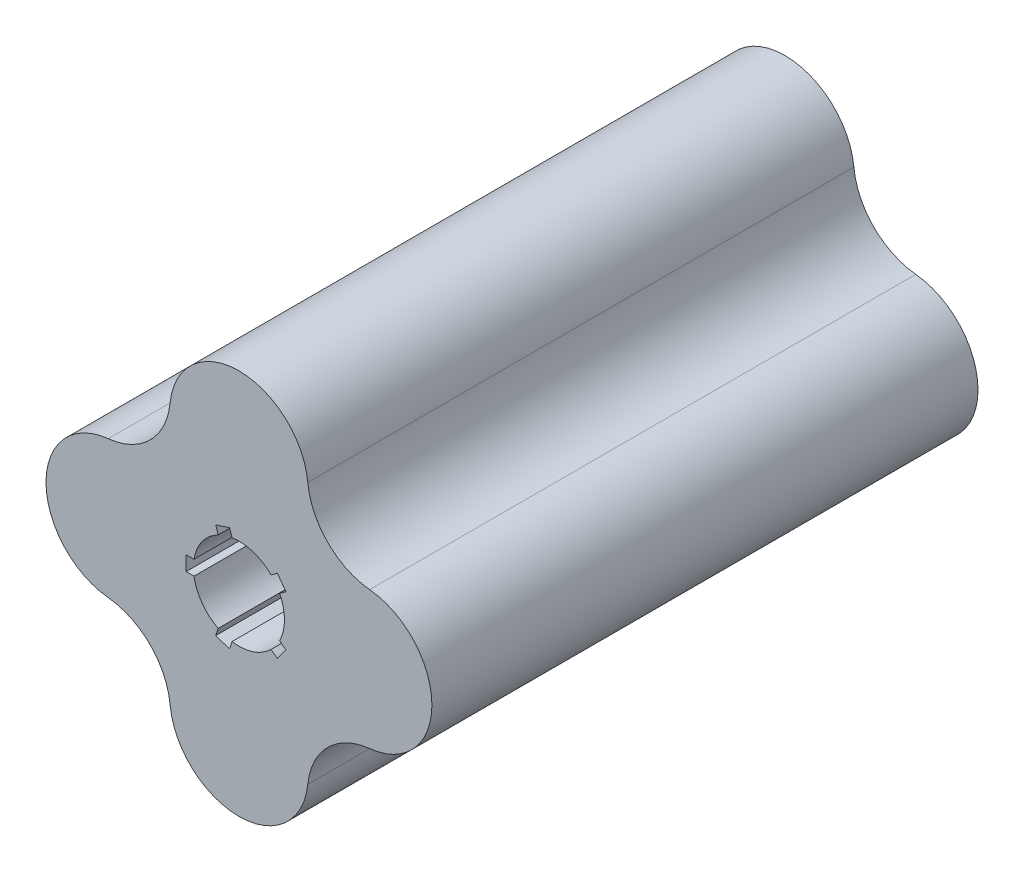
ISO-10303-21;
HEADER;
FILE_DESCRIPTION(('STEP AP214'),'2;1');
FILE_NAME('part.step','',(''),(''),'','','');
FILE_SCHEMA(('AUTOMOTIVE_DESIGN { 1 0 10303 214 1 1 1 1 }'));
ENDSEC;
DATA;
#1=APPLICATION_CONTEXT('core data for automotive mechanical design processes');
#2=APPLICATION_PROTOCOL_DEFINITION('international standard','automotive_design',2000,#1);
#3=PRODUCT_CONTEXT('',#1,'mechanical');
#4=PRODUCT('Part','Part','',(#3));
#5=PRODUCT_RELATED_PRODUCT_CATEGORY('part','',(#4));
#6=PRODUCT_DEFINITION_FORMATION('','',#4);
#7=PRODUCT_DEFINITION_CONTEXT('part definition',#1,'design');
#8=PRODUCT_DEFINITION('design','',#6,#7);
#9=PRODUCT_DEFINITION_SHAPE('','',#8);
#10=(LENGTH_UNIT() NAMED_UNIT(*) SI_UNIT(.MILLI.,.METRE.));
#11=(NAMED_UNIT(*) PLANE_ANGLE_UNIT() SI_UNIT($,.RADIAN.));
#12=(NAMED_UNIT(*) SI_UNIT($,.STERADIAN.) SOLID_ANGLE_UNIT());
#13=UNCERTAINTY_MEASURE_WITH_UNIT(LENGTH_MEASURE(1.E-05),#10,'distance_accuracy_value','');
#14=(GEOMETRIC_REPRESENTATION_CONTEXT(3) GLOBAL_UNCERTAINTY_ASSIGNED_CONTEXT((#13)) GLOBAL_UNIT_ASSIGNED_CONTEXT((#10,
#11,#12)) REPRESENTATION_CONTEXT('',''));
#15=CARTESIAN_POINT('',(0.,0.,0.));
#16=DIRECTION('',(0.,0.,1.));
#17=DIRECTION('',(1.,0.,0.));
#18=AXIS2_PLACEMENT_3D('',#15,#16,#17);
#19=CARTESIAN_POINT('',(0.,0.,150.));
#20=DIRECTION('',(0.,0.,-1.));
#21=DIRECTION('',(-1.,0.,0.));
#22=AXIS2_PLACEMENT_3D('',#19,#20,#21);
#23=CYLINDRICAL_SURFACE('',#22,12.5);
#24=DIRECTION('',(0.,0.,-1.));
#25=VECTOR('',#24,1.);
#26=CARTESIAN_POINT('',(-5.71506219343787,11.1170168716764,150.));
#27=LINE('',#26,#25);
#28=CARTESIAN_POINT('',(-5.71506219343787,11.1170168716764,150.));
#29=VERTEX_POINT('',#28);
#30=CARTESIAN_POINT('',(-5.71506219343787,11.1170168716764,0.));
#31=VERTEX_POINT('',#30);
#32=EDGE_CURVE('E321',#29,#31,#27,.T.);
#33=ORIENTED_EDGE('',*,*,#32,.F.);
#34=CARTESIAN_POINT('',(0.,0.,150.));
#35=DIRECTION('',(0.,0.,1.));
#36=DIRECTION('',(1.,0.,0.));
#37=AXIS2_PLACEMENT_3D('',#34,#35,#36);
#38=CIRCLE('',#37,12.5);
#39=CARTESIAN_POINT('',(-12.3389626792531,2.,150.));
#40=VERTEX_POINT('',#39);
#41=EDGE_CURVE('E370',#29,#40,#38,.T.);
#42=ORIENTED_EDGE('',*,*,#41,.T.);
#43=DIRECTION('',(0.,0.,-1.));
#44=VECTOR('',#43,1.);
#45=CARTESIAN_POINT('',(-12.3389626792531,2.,150.));
#46=LINE('',#45,#44);
#47=CARTESIAN_POINT('',(-12.3389626792531,2.,0.));
#48=VERTEX_POINT('',#47);
#49=EDGE_CURVE('E341',#48,#40,#46,.F.);
#50=ORIENTED_EDGE('',*,*,#49,.F.);
#51=CARTESIAN_POINT('',(0.,0.,0.));
#52=DIRECTION('',(0.,0.,1.));
#53=DIRECTION('',(1.,0.,0.));
#54=AXIS2_PLACEMENT_3D('',#51,#52,#53);
#55=CIRCLE('',#54,12.5);
#56=EDGE_CURVE('E399',#31,#48,#55,.T.);
#57=ORIENTED_EDGE('',*,*,#56,.F.);
#58=EDGE_LOOP('',(#33,#42,#50,#57));
#59=FACE_BOUND('',#58,.T.);
#60=ADVANCED_FACE('F37',(#59),#23,.F.);
#61=DIRECTION('',(0.,0.,-1.));
#62=VECTOR('',#61,1.);
#63=CARTESIAN_POINT('',(-1.91083612825727,12.3530848491762,150.));
#64=LINE('',#63,#62);
#65=CARTESIAN_POINT('',(-1.91083612825727,12.3530848491762,0.));
#66=VERTEX_POINT('',#65);
#67=CARTESIAN_POINT('',(-1.91083612825727,12.3530848491762,150.));
#68=VERTEX_POINT('',#67);
#69=EDGE_CURVE('E319',#66,#68,#64,.F.);
#70=ORIENTED_EDGE('',*,*,#69,.F.);
#71=CARTESIAN_POINT('',(8.80685999588894,8.87069428020215,0.));
#72=VERTEX_POINT('',#71);
#73=EDGE_CURVE('E432',#72,#66,#55,.T.);
#74=ORIENTED_EDGE('',*,*,#73,.F.);
#75=DIRECTION('',(0.,0.,-1.));
#76=VECTOR('',#75,1.);
#77=CARTESIAN_POINT('',(8.80685999588894,8.87069428020215,150.));
#78=LINE('',#77,#76);
#79=CARTESIAN_POINT('',(8.80685999588894,8.87069428020215,150.));
#80=VERTEX_POINT('',#79);
#81=EDGE_CURVE('E317',#80,#72,#78,.T.);
#82=ORIENTED_EDGE('',*,*,#81,.F.);
#83=EDGE_CURVE('E453',#80,#68,#38,.T.);
#84=ORIENTED_EDGE('',*,*,#83,.T.);
#85=EDGE_LOOP('',(#70,#74,#82,#84));
#86=FACE_BOUND('',#85,.T.);
#87=ADVANCED_FACE('F438',(#86),#23,.F.);
#88=DIRECTION('',(0.,0.,-1.));
#89=VECTOR('',#88,1.);
#90=CARTESIAN_POINT('',(11.1580010050589,5.63462630270238,150.));
#91=LINE('',#90,#89);
#92=CARTESIAN_POINT('',(11.1580010050589,5.63462630270238,0.));
#93=VERTEX_POINT('',#92);
#94=CARTESIAN_POINT('',(11.1580010050589,5.63462630270238,150.));
#95=VERTEX_POINT('',#94);
#96=EDGE_CURVE('E315',#93,#95,#91,.F.);
#97=ORIENTED_EDGE('',*,*,#96,.F.);
#98=CARTESIAN_POINT('',(11.1580010050589,-5.63462630270222,0.));
#99=VERTEX_POINT('',#98);
#100=EDGE_CURVE('E441',#99,#93,#55,.T.);
#101=ORIENTED_EDGE('',*,*,#100,.F.);
#102=DIRECTION('',(0.,0.,-1.));
#103=VECTOR('',#102,1.);
#104=CARTESIAN_POINT('',(11.1580010050589,-5.63462630270222,150.));
#105=LINE('',#104,#103);
#106=CARTESIAN_POINT('',(11.1580010050589,-5.63462630270222,150.));
#107=VERTEX_POINT('',#106);
#108=EDGE_CURVE('E313',#107,#99,#105,.T.);
#109=ORIENTED_EDGE('',*,*,#108,.F.);
#110=EDGE_CURVE('E454',#107,#95,#38,.T.);
#111=ORIENTED_EDGE('',*,*,#110,.T.);
#112=EDGE_LOOP('',(#97,#101,#109,#111));
#113=FACE_BOUND('',#112,.T.);
#114=ADVANCED_FACE('F501',(#113),#23,.F.);
#115=DIRECTION('',(0.,0.,-1.));
#116=VECTOR('',#115,1.);
#117=CARTESIAN_POINT('',(8.80685999588907,-8.87069428020202,150.));
#118=LINE('',#117,#116);
#119=CARTESIAN_POINT('',(8.80685999588907,-8.87069428020202,0.));
#120=VERTEX_POINT('',#119);
#121=CARTESIAN_POINT('',(8.80685999588907,-8.87069428020202,150.));
#122=VERTEX_POINT('',#121);
#123=EDGE_CURVE('E242',#120,#122,#118,.F.);
#124=ORIENTED_EDGE('',*,*,#123,.F.);
#125=CARTESIAN_POINT('',(-1.91083612825709,-12.3530848491762,0.));
#126=VERTEX_POINT('',#125);
#127=EDGE_CURVE('E402',#126,#120,#55,.T.);
#128=ORIENTED_EDGE('',*,*,#127,.F.);
#129=DIRECTION('',(0.,0.,-1.));
#130=VECTOR('',#129,1.);
#131=CARTESIAN_POINT('',(-1.91083612825709,-12.3530848491762,150.));
#132=LINE('',#131,#130);
#133=CARTESIAN_POINT('',(-1.91083612825709,-12.3530848491762,150.));
#134=VERTEX_POINT('',#133);
#135=EDGE_CURVE('E310',#134,#126,#132,.T.);
#136=ORIENTED_EDGE('',*,*,#135,.F.);
#137=EDGE_CURVE('E375',#134,#122,#38,.T.);
#138=ORIENTED_EDGE('',*,*,#137,.T.);
#139=EDGE_LOOP('',(#124,#128,#136,#138));
#140=FACE_BOUND('',#139,.T.);
#141=ADVANCED_FACE('F461',(#140),#23,.F.);
#142=CARTESIAN_POINT('',(-37.8086520466848,37.8086520466848,150.));
#143=DIRECTION('',(0.,0.,-1.));
#144=DIRECTION('',(-1.,0.,0.));
#145=AXIS2_PLACEMENT_3D('',#142,#143,#144);
#146=CYLINDRICAL_SURFACE('',#145,19.);
#147=CARTESIAN_POINT('',(-37.8086520466848,37.8086520466848,0.));
#148=DIRECTION('',(0.,0.,1.));
#149=DIRECTION('',(1.,0.,0.));
#150=AXIS2_PLACEMENT_3D('',#147,#148,#149);
#151=CIRCLE('',#150,19.);
#152=CARTESIAN_POINT('',(-35.9043260233424,18.9043260233424,0.));
#153=VERTEX_POINT('',#152);
#154=CARTESIAN_POINT('',(-18.9043260233424,35.9043260233424,0.));
#155=VERTEX_POINT('',#154);
#156=EDGE_CURVE('E348',#153,#155,#151,.T.);
#157=ORIENTED_EDGE('',*,*,#156,.F.);
#158=DIRECTION('',(0.,0.,-1.));
#159=VECTOR('',#158,1.);
#160=CARTESIAN_POINT('',(-35.9043260233424,18.9043260233424,150.));
#161=LINE('',#160,#159);
#162=CARTESIAN_POINT('',(-35.9043260233424,18.9043260233424,150.));
#163=VERTEX_POINT('',#162);
#164=EDGE_CURVE('E416',#163,#153,#161,.T.);
#165=ORIENTED_EDGE('',*,*,#164,.F.);
#166=CARTESIAN_POINT('',(-37.8086520466848,37.8086520466848,150.));
#167=DIRECTION('',(0.,0.,1.));
#168=DIRECTION('',(1.,0.,0.));
#169=AXIS2_PLACEMENT_3D('',#166,#167,#168);
#170=CIRCLE('',#169,19.);
#171=CARTESIAN_POINT('',(-18.9043260233424,35.9043260233424,150.));
#172=VERTEX_POINT('',#171);
#173=EDGE_CURVE('E349',#163,#172,#170,.T.);
#174=ORIENTED_EDGE('',*,*,#173,.T.);
#175=DIRECTION('',(0.,0.,-1.));
#176=VECTOR('',#175,1.);
#177=CARTESIAN_POINT('',(-18.9043260233424,35.9043260233424,150.));
#178=LINE('',#177,#176);
#179=EDGE_CURVE('E374',#172,#155,#178,.T.);
#180=ORIENTED_EDGE('',*,*,#179,.T.);
#181=EDGE_LOOP('',(#157,#165,#174,#180));
#182=FACE_BOUND('',#181,.T.);
#183=ADVANCED_FACE('F39',(#182),#146,.F.);
#184=CARTESIAN_POINT('',(-34.,0.,150.));
#185=DIRECTION('',(0.,0.,-1.));
#186=DIRECTION('',(-1.,0.,0.));
#187=AXIS2_PLACEMENT_3D('',#184,#185,#186);
#188=CYLINDRICAL_SURFACE('',#187,19.);
#189=CARTESIAN_POINT('',(-34.,0.,0.));
#190=DIRECTION('',(0.,0.,1.));
#191=DIRECTION('',(1.,0.,0.));
#192=AXIS2_PLACEMENT_3D('',#189,#190,#191);
#193=CIRCLE('',#192,19.);
#194=CARTESIAN_POINT('',(-35.9043260233424,-18.9043260233424,0.));
#195=VERTEX_POINT('',#194);
#196=EDGE_CURVE('E378',#153,#195,#193,.T.);
#197=ORIENTED_EDGE('',*,*,#196,.T.);
#198=DIRECTION('',(0.,0.,-1.));
#199=VECTOR('',#198,1.);
#200=CARTESIAN_POINT('',(-35.9043260233424,-18.9043260233424,150.));
#201=LINE('',#200,#199);
#202=CARTESIAN_POINT('',(-35.9043260233424,-18.9043260233424,150.));
#203=VERTEX_POINT('',#202);
#204=EDGE_CURVE('E414',#203,#195,#201,.T.);
#205=ORIENTED_EDGE('',*,*,#204,.F.);
#206=CARTESIAN_POINT('',(-34.,0.,150.));
#207=DIRECTION('',(0.,0.,1.));
#208=DIRECTION('',(1.,0.,0.));
#209=AXIS2_PLACEMENT_3D('',#206,#207,#208);
#210=CIRCLE('',#209,19.);
#211=EDGE_CURVE('E352',#163,#203,#210,.T.);
#212=ORIENTED_EDGE('',*,*,#211,.F.);
#213=ORIENTED_EDGE('',*,*,#164,.T.);
#214=EDGE_LOOP('',(#197,#205,#212,#213));
#215=FACE_BOUND('',#214,.T.);
#216=ADVANCED_FACE('F516',(#215),#188,.T.);
#217=CARTESIAN_POINT('',(-37.8086520466848,-37.8086520466848,150.));
#218=DIRECTION('',(0.,0.,-1.));
#219=DIRECTION('',(-1.,0.,0.));
#220=AXIS2_PLACEMENT_3D('',#217,#218,#219);
#221=CYLINDRICAL_SURFACE('',#220,19.);
#222=CARTESIAN_POINT('',(-37.8086520466848,-37.8086520466848,0.));
#223=DIRECTION('',(0.,0.,1.));
#224=DIRECTION('',(1.,0.,0.));
#225=AXIS2_PLACEMENT_3D('',#222,#223,#224);
#226=CIRCLE('',#225,19.);
#227=CARTESIAN_POINT('',(-18.9043260233424,-35.9043260233424,0.));
#228=VERTEX_POINT('',#227);
#229=EDGE_CURVE('E381',#228,#195,#226,.T.);
#230=ORIENTED_EDGE('',*,*,#229,.F.);
#231=DIRECTION('',(0.,0.,-1.));
#232=VECTOR('',#231,1.);
#233=CARTESIAN_POINT('',(-18.9043260233424,-35.9043260233424,150.));
#234=LINE('',#233,#232);
#235=CARTESIAN_POINT('',(-18.9043260233424,-35.9043260233424,150.));
#236=VERTEX_POINT('',#235);
#237=EDGE_CURVE('E412',#236,#228,#234,.T.);
#238=ORIENTED_EDGE('',*,*,#237,.F.);
#239=CARTESIAN_POINT('',(-37.8086520466848,-37.8086520466848,150.));
#240=DIRECTION('',(0.,0.,1.));
#241=DIRECTION('',(1.,0.,0.));
#242=AXIS2_PLACEMENT_3D('',#239,#240,#241);
#243=CIRCLE('',#242,19.);
#244=EDGE_CURVE('E355',#236,#203,#243,.T.);
#245=ORIENTED_EDGE('',*,*,#244,.T.);
#246=ORIENTED_EDGE('',*,*,#204,.T.);
#247=EDGE_LOOP('',(#230,#238,#245,#246));
#248=FACE_BOUND('',#247,.T.);
#249=ADVANCED_FACE('F735',(#248),#221,.F.);
#250=CARTESIAN_POINT('',(0.,-34.,150.));
#251=DIRECTION('',(0.,0.,-1.));
#252=DIRECTION('',(-1.,0.,0.));
#253=AXIS2_PLACEMENT_3D('',#250,#251,#252);
#254=CYLINDRICAL_SURFACE('',#253,19.);
#255=CARTESIAN_POINT('',(0.,-34.,0.));
#256=DIRECTION('',(0.,0.,1.));
#257=DIRECTION('',(1.,0.,0.));
#258=AXIS2_PLACEMENT_3D('',#255,#256,#257);
#259=CIRCLE('',#258,19.);
#260=CARTESIAN_POINT('',(18.9043260233424,-35.9043260233424,0.));
#261=VERTEX_POINT('',#260);
#262=EDGE_CURVE('E384',#228,#261,#259,.T.);
#263=ORIENTED_EDGE('',*,*,#262,.T.);
#264=DIRECTION('',(0.,0.,-1.));
#265=VECTOR('',#264,1.);
#266=CARTESIAN_POINT('',(18.9043260233424,-35.9043260233424,150.));
#267=LINE('',#266,#265);
#268=CARTESIAN_POINT('',(18.9043260233424,-35.9043260233424,150.));
#269=VERTEX_POINT('',#268);
#270=EDGE_CURVE('E410',#269,#261,#267,.T.);
#271=ORIENTED_EDGE('',*,*,#270,.F.);
#272=CARTESIAN_POINT('',(0.,-34.,150.));
#273=DIRECTION('',(0.,0.,1.));
#274=DIRECTION('',(1.,0.,0.));
#275=AXIS2_PLACEMENT_3D('',#272,#273,#274);
#276=CIRCLE('',#275,19.);
#277=EDGE_CURVE('E358',#236,#269,#276,.T.);
#278=ORIENTED_EDGE('',*,*,#277,.F.);
#279=ORIENTED_EDGE('',*,*,#237,.T.);
#280=EDGE_LOOP('',(#263,#271,#278,#279));
#281=FACE_BOUND('',#280,.T.);
#282=ADVANCED_FACE('F726',(#281),#254,.T.);
#283=CARTESIAN_POINT('',(37.8086520466848,-37.8086520466848,150.));
#284=DIRECTION('',(0.,0.,-1.));
#285=DIRECTION('',(-1.,0.,0.));
#286=AXIS2_PLACEMENT_3D('',#283,#284,#285);
#287=CYLINDRICAL_SURFACE('',#286,19.);
#288=CARTESIAN_POINT('',(37.8086520466848,-37.8086520466848,0.));
#289=DIRECTION('',(0.,0.,1.));
#290=DIRECTION('',(1.,0.,0.));
#291=AXIS2_PLACEMENT_3D('',#288,#289,#290);
#292=CIRCLE('',#291,19.);
#293=CARTESIAN_POINT('',(35.9043260233424,-18.9043260233424,0.));
#294=VERTEX_POINT('',#293);
#295=EDGE_CURVE('E387',#294,#261,#292,.T.);
#296=ORIENTED_EDGE('',*,*,#295,.F.);
#297=DIRECTION('',(0.,0.,-1.));
#298=VECTOR('',#297,1.);
#299=CARTESIAN_POINT('',(35.9043260233424,-18.9043260233424,150.));
#300=LINE('',#299,#298);
#301=CARTESIAN_POINT('',(35.9043260233424,-18.9043260233424,150.));
#302=VERTEX_POINT('',#301);
#303=EDGE_CURVE('E408',#302,#294,#300,.T.);
#304=ORIENTED_EDGE('',*,*,#303,.F.);
#305=CARTESIAN_POINT('',(37.8086520466848,-37.8086520466848,150.));
#306=DIRECTION('',(0.,0.,1.));
#307=DIRECTION('',(1.,0.,0.));
#308=AXIS2_PLACEMENT_3D('',#305,#306,#307);
#309=CIRCLE('',#308,19.);
#310=EDGE_CURVE('E360',#302,#269,#309,.T.);
#311=ORIENTED_EDGE('',*,*,#310,.T.);
#312=ORIENTED_EDGE('',*,*,#270,.T.);
#313=EDGE_LOOP('',(#296,#304,#311,#312));
#314=FACE_BOUND('',#313,.T.);
#315=ADVANCED_FACE('F717',(#314),#287,.F.);
#316=CARTESIAN_POINT('',(34.,0.,150.));
#317=DIRECTION('',(0.,0.,-1.));
#318=DIRECTION('',(-1.,0.,0.));
#319=AXIS2_PLACEMENT_3D('',#316,#317,#318);
#320=CYLINDRICAL_SURFACE('',#319,19.);
#321=CARTESIAN_POINT('',(34.,0.,0.));
#322=DIRECTION('',(0.,0.,1.));
#323=DIRECTION('',(1.,0.,0.));
#324=AXIS2_PLACEMENT_3D('',#321,#322,#323);
#325=CIRCLE('',#324,19.);
#326=CARTESIAN_POINT('',(35.9043260233424,18.9043260233424,0.));
#327=VERTEX_POINT('',#326);
#328=EDGE_CURVE('E390',#294,#327,#325,.T.);
#329=ORIENTED_EDGE('',*,*,#328,.T.);
#330=DIRECTION('',(0.,0.,-1.));
#331=VECTOR('',#330,1.);
#332=CARTESIAN_POINT('',(35.9043260233424,18.9043260233424,150.));
#333=LINE('',#332,#331);
#334=CARTESIAN_POINT('',(35.9043260233424,18.9043260233424,150.));
#335=VERTEX_POINT('',#334);
#336=EDGE_CURVE('E406',#335,#327,#333,.T.);
#337=ORIENTED_EDGE('',*,*,#336,.F.);
#338=CARTESIAN_POINT('',(34.,0.,150.));
#339=DIRECTION('',(0.,0.,1.));
#340=DIRECTION('',(1.,0.,0.));
#341=AXIS2_PLACEMENT_3D('',#338,#339,#340);
#342=CIRCLE('',#341,19.);
#343=EDGE_CURVE('E363',#302,#335,#342,.T.);
#344=ORIENTED_EDGE('',*,*,#343,.F.);
#345=ORIENTED_EDGE('',*,*,#303,.T.);
#346=EDGE_LOOP('',(#329,#337,#344,#345));
#347=FACE_BOUND('',#346,.T.);
#348=ADVANCED_FACE('F708',(#347),#320,.T.);
#349=CARTESIAN_POINT('',(37.8086520466848,37.8086520466848,150.));
#350=DIRECTION('',(0.,0.,-1.));
#351=DIRECTION('',(-1.,0.,0.));
#352=AXIS2_PLACEMENT_3D('',#349,#350,#351);
#353=CYLINDRICAL_SURFACE('',#352,19.);
#354=CARTESIAN_POINT('',(37.8086520466848,37.8086520466848,0.));
#355=DIRECTION('',(0.,0.,1.));
#356=DIRECTION('',(1.,0.,0.));
#357=AXIS2_PLACEMENT_3D('',#354,#355,#356);
#358=CIRCLE('',#357,19.);
#359=CARTESIAN_POINT('',(18.9043260233424,35.9043260233424,0.));
#360=VERTEX_POINT('',#359);
#361=EDGE_CURVE('E393',#360,#327,#358,.T.);
#362=ORIENTED_EDGE('',*,*,#361,.F.);
#363=DIRECTION('',(0.,0.,-1.));
#364=VECTOR('',#363,1.);
#365=CARTESIAN_POINT('',(18.9043260233424,35.9043260233424,150.));
#366=LINE('',#365,#364);
#367=CARTESIAN_POINT('',(18.9043260233424,35.9043260233424,150.));
#368=VERTEX_POINT('',#367);
#369=EDGE_CURVE('E404',#368,#360,#366,.T.);
#370=ORIENTED_EDGE('',*,*,#369,.F.);
#371=CARTESIAN_POINT('',(37.8086520466848,37.8086520466848,150.));
#372=DIRECTION('',(0.,0.,1.));
#373=DIRECTION('',(1.,0.,0.));
#374=AXIS2_PLACEMENT_3D('',#371,#372,#373);
#375=CIRCLE('',#374,19.);
#376=EDGE_CURVE('E365',#368,#335,#375,.T.);
#377=ORIENTED_EDGE('',*,*,#376,.T.);
#378=ORIENTED_EDGE('',*,*,#336,.T.);
#379=EDGE_LOOP('',(#362,#370,#377,#378));
#380=FACE_BOUND('',#379,.T.);
#381=ADVANCED_FACE('F509',(#380),#353,.F.);
#382=CARTESIAN_POINT('',(0.,34.,150.));
#383=DIRECTION('',(0.,0.,-1.));
#384=DIRECTION('',(-1.,0.,0.));
#385=AXIS2_PLACEMENT_3D('',#382,#383,#384);
#386=CYLINDRICAL_SURFACE('',#385,19.);
#387=CARTESIAN_POINT('',(0.,34.,0.));
#388=DIRECTION('',(0.,0.,1.));
#389=DIRECTION('',(1.,0.,0.));
#390=AXIS2_PLACEMENT_3D('',#387,#388,#389);
#391=CIRCLE('',#390,19.);
#392=EDGE_CURVE('E396',#360,#155,#391,.T.);
#393=ORIENTED_EDGE('',*,*,#392,.T.);
#394=ORIENTED_EDGE('',*,*,#179,.F.);
#395=CARTESIAN_POINT('',(0.,34.,150.));
#396=DIRECTION('',(0.,0.,1.));
#397=DIRECTION('',(1.,0.,0.));
#398=AXIS2_PLACEMENT_3D('',#395,#396,#397);
#399=CIRCLE('',#398,19.);
#400=EDGE_CURVE('E368',#368,#172,#399,.T.);
#401=ORIENTED_EDGE('',*,*,#400,.F.);
#402=ORIENTED_EDGE('',*,*,#369,.T.);
#403=EDGE_LOOP('',(#393,#394,#401,#402));
#404=FACE_BOUND('',#403,.T.);
#405=ADVANCED_FACE('F504',(#404),#386,.T.);
#406=DIRECTION('',(0.,0.,-1.));
#407=VECTOR('',#406,1.);
#408=CARTESIAN_POINT('',(-5.71506219343771,-11.1170168716765,150.));
#409=LINE('',#408,#407);
#410=CARTESIAN_POINT('',(-5.71506219343771,-11.1170168716765,0.));
#411=VERTEX_POINT('',#410);
#412=CARTESIAN_POINT('',(-5.71506219343771,-11.1170168716765,150.));
#413=VERTEX_POINT('',#412);
#414=EDGE_CURVE('E306',#411,#413,#409,.F.);
#415=ORIENTED_EDGE('',*,*,#414,.F.);
#416=CARTESIAN_POINT('',(-12.3389626792531,-2.,0.));
#417=VERTEX_POINT('',#416);
#418=EDGE_CURVE('E353',#417,#411,#55,.T.);
#419=ORIENTED_EDGE('',*,*,#418,.F.);
#420=DIRECTION('',(0.,0.,-1.));
#421=VECTOR('',#420,1.);
#422=CARTESIAN_POINT('',(-12.3389626792531,-2.,150.));
#423=LINE('',#422,#421);
#424=CARTESIAN_POINT('',(-12.3389626792531,-2.,150.));
#425=VERTEX_POINT('',#424);
#426=EDGE_CURVE('E346',#425,#417,#423,.T.);
#427=ORIENTED_EDGE('',*,*,#426,.F.);
#428=EDGE_CURVE('E371',#425,#413,#38,.T.);
#429=ORIENTED_EDGE('',*,*,#428,.T.);
#430=EDGE_LOOP('',(#415,#419,#427,#429));
#431=FACE_BOUND('',#430,.T.);
#432=ADVANCED_FACE('F478',(#431),#23,.F.);
#433=CARTESIAN_POINT('',(0.,0.,150.));
#434=DIRECTION('',(0.,0.,1.));
#435=DIRECTION('',(1.,0.,0.));
#436=AXIS2_PLACEMENT_3D('',#433,#434,#435);
#437=PLANE('',#436);
#438=DIRECTION('',(-0.309016994374958,0.95105651629515,0.));
#439=VECTOR('',#438,1.);
#440=CARTESIAN_POINT('',(-5.14679147352736,9.36805943234916,150.));
#441=LINE('',#440,#439);
#442=CARTESIAN_POINT('',(-6.3828594510272,13.1722854975298,150.));
#443=VERTEX_POINT('',#442);
#444=EDGE_CURVE('E283',#29,#443,#441,.T.);
#445=ORIENTED_EDGE('',*,*,#444,.T.);
#446=DIRECTION('',(0.95105651629515,0.309016994374958,0.));
#447=VECTOR('',#446,1.);
#448=CARTESIAN_POINT('',(-2.5786333858466,14.4083534750296,150.));
#449=LINE('',#448,#447);
#450=CARTESIAN_POINT('',(-2.5786333858466,14.4083534750296,150.));
#451=VERTEX_POINT('',#450);
#452=EDGE_CURVE('E276',#443,#451,#449,.T.);
#453=ORIENTED_EDGE('',*,*,#452,.T.);
#454=DIRECTION('',(0.309016994374958,-0.95105651629515,0.));
#455=VECTOR('',#454,1.);
#456=CARTESIAN_POINT('',(-1.34256540834676,10.604127409849,150.));
#457=LINE('',#456,#455);
#458=EDGE_CURVE('E279',#451,#68,#457,.T.);
#459=ORIENTED_EDGE('',*,*,#458,.T.);
#460=ORIENTED_EDGE('',*,*,#83,.F.);
#461=DIRECTION('',(0.809016994374942,0.58778525229248,0.));
#462=VECTOR('',#461,1.);
#463=CARTESIAN_POINT('',(7.31910793635193,7.78977913782093,150.));
#464=LINE('',#463,#462);
#465=CARTESIAN_POINT('',(10.5551759138517,10.1409201469908,150.));
#466=VERTEX_POINT('',#465);
#467=EDGE_CURVE('E267',#80,#466,#464,.T.);
#468=ORIENTED_EDGE('',*,*,#467,.T.);
#469=DIRECTION('',(0.58778525229248,-0.809016994374942,0.));
#470=VECTOR('',#469,1.);
#471=CARTESIAN_POINT('',(12.9063169230216,6.90485216949108,150.));
#472=LINE('',#471,#470);
#473=CARTESIAN_POINT('',(12.9063169230216,6.90485216949108,150.));
#474=VERTEX_POINT('',#473);
#475=EDGE_CURVE('E260',#466,#474,#472,.T.);
#476=ORIENTED_EDGE('',*,*,#475,.T.);
#477=DIRECTION('',(-0.809016994374942,-0.58778525229248,0.));
#478=VECTOR('',#477,1.);
#479=CARTESIAN_POINT('',(9.67024894552186,4.55371116032116,150.));
#480=LINE('',#479,#478);
#481=EDGE_CURVE('E263',#474,#95,#480,.T.);
#482=ORIENTED_EDGE('',*,*,#481,.T.);
#483=ORIENTED_EDGE('',*,*,#110,.F.);
#484=DIRECTION('',(0.809016994374951,-0.587785252292469,0.));
#485=VECTOR('',#484,1.);
#486=CARTESIAN_POINT('',(9.67024894552192,-4.55371116032102,150.));
#487=LINE('',#486,#485);
#488=CARTESIAN_POINT('',(12.9063169230217,-6.90485216949089,150.));
#489=VERTEX_POINT('',#488);
#490=EDGE_CURVE('E236',#107,#489,#487,.T.);
#491=ORIENTED_EDGE('',*,*,#490,.T.);
#492=DIRECTION('',(-0.587785252292469,-0.809016994374951,0.));
#493=VECTOR('',#492,1.);
#494=CARTESIAN_POINT('',(10.5551759138518,-10.1409201469907,150.));
#495=LINE('',#494,#493);
#496=CARTESIAN_POINT('',(10.5551759138518,-10.1409201469907,150.));
#497=VERTEX_POINT('',#496);
#498=EDGE_CURVE('E229',#489,#497,#495,.T.);
#499=ORIENTED_EDGE('',*,*,#498,.T.);
#500=DIRECTION('',(-0.809016994374951,0.587785252292469,0.));
#501=VECTOR('',#500,1.);
#502=CARTESIAN_POINT('',(7.31910793635205,-7.78977913782082,150.));
#503=LINE('',#502,#501);
#504=EDGE_CURVE('E239',#497,#122,#503,.T.);
#505=ORIENTED_EDGE('',*,*,#504,.T.);
#506=ORIENTED_EDGE('',*,*,#137,.F.);
#507=DIRECTION('',(-0.309016994374945,-0.951056516295155,0.));
#508=VECTOR('',#507,1.);
#509=CARTESIAN_POINT('',(-1.34256540834661,-10.604127409849,150.));
#510=LINE('',#509,#508);
#511=CARTESIAN_POINT('',(-2.57863338584639,-14.4083534750296,150.));
#512=VERTEX_POINT('',#511);
#513=EDGE_CURVE('E297',#134,#512,#510,.T.);
#514=ORIENTED_EDGE('',*,*,#513,.T.);
#515=DIRECTION('',(-0.951056516295155,0.309016994374945,0.));
#516=VECTOR('',#515,1.);
#517=CARTESIAN_POINT('',(-6.38285945102701,-13.1722854975299,150.));
#518=LINE('',#517,#516);
#519=CARTESIAN_POINT('',(-6.38285945102701,-13.1722854975299,150.));
#520=VERTEX_POINT('',#519);
#521=EDGE_CURVE('E290',#512,#520,#518,.T.);
#522=ORIENTED_EDGE('',*,*,#521,.T.);
#523=DIRECTION('',(0.309016994374945,0.951056516295155,0.));
#524=VECTOR('',#523,1.);
#525=CARTESIAN_POINT('',(-5.14679147352723,-9.36805943234924,150.));
#526=LINE('',#525,#524);
#527=EDGE_CURVE('E293',#520,#413,#526,.T.);
#528=ORIENTED_EDGE('',*,*,#527,.T.);
#529=ORIENTED_EDGE('',*,*,#428,.F.);
#530=DIRECTION('',(-1.,0.,0.));
#531=VECTOR('',#530,1.);
#532=CARTESIAN_POINT('',(-10.5,-2.,150.));
#533=LINE('',#532,#531);
#534=CARTESIAN_POINT('',(-14.5,-2.,150.));
#535=VERTEX_POINT('',#534);
#536=EDGE_CURVE('E331',#425,#535,#533,.T.);
#537=ORIENTED_EDGE('',*,*,#536,.T.);
#538=DIRECTION('',(0.,1.,0.));
#539=VECTOR('',#538,1.);
#540=CARTESIAN_POINT('',(-14.5,2.,150.));
#541=LINE('',#540,#539);
#542=CARTESIAN_POINT('',(-14.5,2.,150.));
#543=VERTEX_POINT('',#542);
#544=EDGE_CURVE('E324',#535,#543,#541,.T.);
#545=ORIENTED_EDGE('',*,*,#544,.T.);
#546=DIRECTION('',(1.,0.,0.));
#547=VECTOR('',#546,1.);
#548=CARTESIAN_POINT('',(-10.5,2.,150.));
#549=LINE('',#548,#547);
#550=EDGE_CURVE('E327',#543,#40,#549,.T.);
#551=ORIENTED_EDGE('',*,*,#550,.T.);
#552=ORIENTED_EDGE('',*,*,#41,.F.);
#553=EDGE_LOOP('',(#445,#453,#459,#460,#468,#476,#482,#483,#491,#499,#505,#506,#514,#522,#528,
#529,#537,#545,#551,#552));
#554=FACE_BOUND('',#553,.T.);
#555=ORIENTED_EDGE('',*,*,#173,.F.);
#556=ORIENTED_EDGE('',*,*,#211,.T.);
#557=ORIENTED_EDGE('',*,*,#244,.F.);
#558=ORIENTED_EDGE('',*,*,#277,.T.);
#559=ORIENTED_EDGE('',*,*,#310,.F.);
#560=ORIENTED_EDGE('',*,*,#343,.T.);
#561=ORIENTED_EDGE('',*,*,#376,.F.);
#562=ORIENTED_EDGE('',*,*,#400,.T.);
#563=EDGE_LOOP('',(#555,#556,#557,#558,#559,#560,#561,#562));
#564=FACE_BOUND('',#563,.T.);
#565=ADVANCED_FACE('F248',(#554,#564),#437,.T.);
#566=CARTESIAN_POINT('',(0.,0.,0.));
#567=DIRECTION('',(0.,0.,1.));
#568=DIRECTION('',(1.,0.,0.));
#569=AXIS2_PLACEMENT_3D('',#566,#567,#568);
#570=PLANE('',#569);
#571=ORIENTED_EDGE('',*,*,#156,.T.);
#572=ORIENTED_EDGE('',*,*,#392,.F.);
#573=ORIENTED_EDGE('',*,*,#361,.T.);
#574=ORIENTED_EDGE('',*,*,#328,.F.);
#575=ORIENTED_EDGE('',*,*,#295,.T.);
#576=ORIENTED_EDGE('',*,*,#262,.F.);
#577=ORIENTED_EDGE('',*,*,#229,.T.);
#578=ORIENTED_EDGE('',*,*,#196,.F.);
#579=EDGE_LOOP('',(#571,#572,#573,#574,#575,#576,#577,#578));
#580=FACE_BOUND('',#579,.T.);
#581=DIRECTION('',(0.95105651629515,0.309016994374958,0.));
#582=VECTOR('',#581,1.);
#583=CARTESIAN_POINT('',(-2.5786333858466,14.4083534750296,0.));
#584=LINE('',#583,#582);
#585=CARTESIAN_POINT('',(-6.3828594510272,13.1722854975298,0.));
#586=VERTEX_POINT('',#585);
#587=CARTESIAN_POINT('',(-2.57863338584659,14.4083534750296,0.));
#588=VERTEX_POINT('',#587);
#589=EDGE_CURVE('E52',#586,#588,#584,.T.);
#590=ORIENTED_EDGE('',*,*,#589,.F.);
#591=DIRECTION('',(0.309016994374958,-0.95105651629515,0.));
#592=VECTOR('',#591,1.);
#593=CARTESIAN_POINT('',(-1.9021130325903,-0.618033988749917,0.));
#594=LINE('',#593,#592);
#595=EDGE_CURVE('E11',#586,#31,#594,.T.);
#596=ORIENTED_EDGE('',*,*,#595,.T.);
#597=ORIENTED_EDGE('',*,*,#56,.T.);
#598=DIRECTION('',(1.,0.,0.));
#599=VECTOR('',#598,1.);
#600=CARTESIAN_POINT('',(-10.5,2.,0.));
#601=LINE('',#600,#599);
#602=CARTESIAN_POINT('',(-14.5,2.,0.));
#603=VERTEX_POINT('',#602);
#604=EDGE_CURVE('E328',#603,#48,#601,.T.);
#605=ORIENTED_EDGE('',*,*,#604,.F.);
#606=DIRECTION('',(0.,1.,0.));
#607=VECTOR('',#606,1.);
#608=CARTESIAN_POINT('',(-14.5,2.,0.));
#609=LINE('',#608,#607);
#610=CARTESIAN_POINT('',(-14.5,-2.,0.));
#611=VERTEX_POINT('',#610);
#612=EDGE_CURVE('E323',#611,#603,#609,.T.);
#613=ORIENTED_EDGE('',*,*,#612,.F.);
#614=DIRECTION('',(1.,0.,0.));
#615=VECTOR('',#614,1.);
#616=CARTESIAN_POINT('',(0.,-2.,0.));
#617=LINE('',#616,#615);
#618=EDGE_CURVE('E418',#611,#417,#617,.T.);
#619=ORIENTED_EDGE('',*,*,#618,.T.);
#620=ORIENTED_EDGE('',*,*,#418,.T.);
#621=DIRECTION('',(0.309016994374945,0.951056516295155,0.));
#622=VECTOR('',#621,1.);
#623=CARTESIAN_POINT('',(-5.14679147352723,-9.36805943234924,0.));
#624=LINE('',#623,#622);
#625=CARTESIAN_POINT('',(-6.38285945102701,-13.1722854975299,0.));
#626=VERTEX_POINT('',#625);
#627=EDGE_CURVE('E294',#626,#411,#624,.T.);
#628=ORIENTED_EDGE('',*,*,#627,.F.);
#629=DIRECTION('',(-0.951056516295155,0.309016994374945,0.));
#630=VECTOR('',#629,1.);
#631=CARTESIAN_POINT('',(-6.38285945102701,-13.1722854975299,0.));
#632=LINE('',#631,#630);
#633=CARTESIAN_POINT('',(-2.57863338584639,-14.4083534750296,0.));
#634=VERTEX_POINT('',#633);
#635=EDGE_CURVE('E258',#634,#626,#632,.T.);
#636=ORIENTED_EDGE('',*,*,#635,.F.);
#637=DIRECTION('',(0.309016994374945,0.951056516295155,0.));
#638=VECTOR('',#637,1.);
#639=CARTESIAN_POINT('',(1.90211303259031,-0.61803398874989,0.));
#640=LINE('',#639,#638);
#641=EDGE_CURVE('E421',#634,#126,#640,.T.);
#642=ORIENTED_EDGE('',*,*,#641,.T.);
#643=ORIENTED_EDGE('',*,*,#127,.T.);
#644=DIRECTION('',(-0.809016994374951,0.587785252292469,0.));
#645=VECTOR('',#644,1.);
#646=CARTESIAN_POINT('',(7.31910793635205,-7.78977913782082,0.));
#647=LINE('',#646,#645);
#648=CARTESIAN_POINT('',(10.5551759138518,-10.1409201469907,0.));
#649=VERTEX_POINT('',#648);
#650=EDGE_CURVE('E251',#649,#120,#647,.T.);
#651=ORIENTED_EDGE('',*,*,#650,.F.);
#652=DIRECTION('',(-0.587785252292469,-0.809016994374951,0.));
#653=VECTOR('',#652,1.);
#654=CARTESIAN_POINT('',(10.5551759138518,-10.1409201469907,0.));
#655=LINE('',#654,#653);
#656=CARTESIAN_POINT('',(12.9063169230217,-6.90485216949089,0.));
#657=VERTEX_POINT('',#656);
#658=EDGE_CURVE('E232',#657,#649,#655,.T.);
#659=ORIENTED_EDGE('',*,*,#658,.F.);
#660=DIRECTION('',(-0.809016994374951,0.587785252292469,0.));
#661=VECTOR('',#660,1.);
#662=CARTESIAN_POINT('',(1.17557050458494,1.6180339887499,0.));
#663=LINE('',#662,#661);
#664=EDGE_CURVE('E424',#657,#99,#663,.T.);
#665=ORIENTED_EDGE('',*,*,#664,.T.);
#666=ORIENTED_EDGE('',*,*,#100,.T.);
#667=DIRECTION('',(-0.809016994374942,-0.58778525229248,0.));
#668=VECTOR('',#667,1.);
#669=CARTESIAN_POINT('',(9.67024894552186,4.55371116032116,0.));
#670=LINE('',#669,#668);
#671=CARTESIAN_POINT('',(12.9063169230216,6.90485216949108,0.));
#672=VERTEX_POINT('',#671);
#673=EDGE_CURVE('E264',#672,#93,#670,.T.);
#674=ORIENTED_EDGE('',*,*,#673,.F.);
#675=DIRECTION('',(0.58778525229248,-0.809016994374942,0.));
#676=VECTOR('',#675,1.);
#677=CARTESIAN_POINT('',(12.9063169230216,6.90485216949108,0.));
#678=LINE('',#677,#676);
#679=CARTESIAN_POINT('',(10.5551759138517,10.1409201469908,0.));
#680=VERTEX_POINT('',#679);
#681=EDGE_CURVE('E60',#680,#672,#678,.T.);
#682=ORIENTED_EDGE('',*,*,#681,.F.);
#683=DIRECTION('',(-0.809016994374942,-0.58778525229248,0.));
#684=VECTOR('',#683,1.);
#685=CARTESIAN_POINT('',(-1.17557050458496,1.61803398874989,0.));
#686=LINE('',#685,#684);
#687=EDGE_CURVE('E45',#680,#72,#686,.T.);
#688=ORIENTED_EDGE('',*,*,#687,.T.);
#689=ORIENTED_EDGE('',*,*,#73,.T.);
#690=DIRECTION('',(0.309016994374958,-0.95105651629515,0.));
#691=VECTOR('',#690,1.);
#692=CARTESIAN_POINT('',(-1.34256540834676,10.604127409849,0.));
#693=LINE('',#692,#691);
#694=EDGE_CURVE('E280',#588,#66,#693,.T.);
#695=ORIENTED_EDGE('',*,*,#694,.F.);
#696=EDGE_LOOP('',(#590,#596,#597,#605,#613,#619,#620,#628,#636,#642,#643,#651,#659,#665,#666,
#674,#682,#688,#689,#695));
#697=FACE_BOUND('',#696,.T.);
#698=ADVANCED_FACE('F430',(#580,#697),#570,.F.);
#699=CARTESIAN_POINT('',(-14.5,2.,150.));
#700=DIRECTION('',(-1.,0.,0.));
#701=DIRECTION('',(0.,0.,1.));
#702=AXIS2_PLACEMENT_3D('',#699,#700,#701);
#703=PLANE('',#702);
#704=ORIENTED_EDGE('',*,*,#612,.T.);
#705=DIRECTION('',(0.,0.,-1.));
#706=VECTOR('',#705,1.);
#707=CARTESIAN_POINT('',(-14.5,2.,150.));
#708=LINE('',#707,#706);
#709=EDGE_CURVE('E334',#543,#603,#708,.T.);
#710=ORIENTED_EDGE('',*,*,#709,.F.);
#711=ORIENTED_EDGE('',*,*,#544,.F.);
#712=DIRECTION('',(0.,0.,-1.));
#713=VECTOR('',#712,1.);
#714=CARTESIAN_POINT('',(-14.5,-2.,150.));
#715=LINE('',#714,#713);
#716=EDGE_CURVE('E338',#535,#611,#715,.T.);
#717=ORIENTED_EDGE('',*,*,#716,.T.);
#718=EDGE_LOOP('',(#704,#710,#711,#717));
#719=FACE_BOUND('',#718,.T.);
#720=ADVANCED_FACE('F483',(#719),#703,.F.);
#721=CARTESIAN_POINT('',(-10.5,-2.,150.));
#722=DIRECTION('',(0.,-1.,0.));
#723=DIRECTION('',(0.,0.,-1.));
#724=AXIS2_PLACEMENT_3D('',#721,#722,#723);
#725=PLANE('',#724);
#726=ORIENTED_EDGE('',*,*,#426,.T.);
#727=ORIENTED_EDGE('',*,*,#618,.F.);
#728=ORIENTED_EDGE('',*,*,#716,.F.);
#729=ORIENTED_EDGE('',*,*,#536,.F.);
#730=EDGE_LOOP('',(#726,#727,#728,#729));
#731=FACE_BOUND('',#730,.T.);
#732=ADVANCED_FACE('F481',(#731),#725,.F.);
#733=CARTESIAN_POINT('',(-10.5,2.,150.));
#734=DIRECTION('',(0.,1.,0.));
#735=DIRECTION('',(0.,0.,1.));
#736=AXIS2_PLACEMENT_3D('',#733,#734,#735);
#737=PLANE('',#736);
#738=ORIENTED_EDGE('',*,*,#49,.T.);
#739=ORIENTED_EDGE('',*,*,#550,.F.);
#740=ORIENTED_EDGE('',*,*,#709,.T.);
#741=ORIENTED_EDGE('',*,*,#604,.T.);
#742=EDGE_LOOP('',(#738,#739,#740,#741));
#743=FACE_BOUND('',#742,.T.);
#744=ADVANCED_FACE('F450',(#743),#737,.F.);
#745=CARTESIAN_POINT('',(-6.38285945102701,-13.1722854975299,150.));
#746=DIRECTION('',(-0.309016994374945,-0.951056516295154,0.));
#747=DIRECTION('',(0.951056516295155,-0.309016994374945,0.));
#748=AXIS2_PLACEMENT_3D('',#745,#746,#747);
#749=PLANE('',#748);
#750=ORIENTED_EDGE('',*,*,#635,.T.);
#751=DIRECTION('',(0.,0.,-1.));
#752=VECTOR('',#751,1.);
#753=CARTESIAN_POINT('',(-6.38285945102701,-13.1722854975299,150.));
#754=LINE('',#753,#752);
#755=EDGE_CURVE('E300',#520,#626,#754,.T.);
#756=ORIENTED_EDGE('',*,*,#755,.F.);
#757=ORIENTED_EDGE('',*,*,#521,.F.);
#758=DIRECTION('',(0.,0.,-1.));
#759=VECTOR('',#758,1.);
#760=CARTESIAN_POINT('',(-2.57863338584639,-14.4083534750296,150.));
#761=LINE('',#760,#759);
#762=EDGE_CURVE('E303',#512,#634,#761,.T.);
#763=ORIENTED_EDGE('',*,*,#762,.T.);
#764=EDGE_LOOP('',(#750,#756,#757,#763));
#765=FACE_BOUND('',#764,.T.);
#766=ADVANCED_FACE('F469',(#765),#749,.F.);
#767=CARTESIAN_POINT('',(-1.34256540834661,-10.604127409849,150.));
#768=DIRECTION('',(0.951056516295154,-0.309016994374945,0.));
#769=DIRECTION('',(0.309016994374945,0.951056516295155,0.));
#770=AXIS2_PLACEMENT_3D('',#767,#768,#769);
#771=PLANE('',#770);
#772=ORIENTED_EDGE('',*,*,#135,.T.);
#773=ORIENTED_EDGE('',*,*,#641,.F.);
#774=ORIENTED_EDGE('',*,*,#762,.F.);
#775=ORIENTED_EDGE('',*,*,#513,.F.);
#776=EDGE_LOOP('',(#772,#773,#774,#775));
#777=FACE_BOUND('',#776,.T.);
#778=ADVANCED_FACE('F466',(#777),#771,.F.);
#779=CARTESIAN_POINT('',(-5.14679147352723,-9.36805943234924,150.));
#780=DIRECTION('',(-0.951056516295154,0.309016994374945,0.));
#781=DIRECTION('',(-0.309016994374945,-0.951056516295155,0.));
#782=AXIS2_PLACEMENT_3D('',#779,#780,#781);
#783=PLANE('',#782);
#784=ORIENTED_EDGE('',*,*,#414,.T.);
#785=ORIENTED_EDGE('',*,*,#527,.F.);
#786=ORIENTED_EDGE('',*,*,#755,.T.);
#787=ORIENTED_EDGE('',*,*,#627,.T.);
#788=EDGE_LOOP('',(#784,#785,#786,#787));
#789=FACE_BOUND('',#788,.T.);
#790=ADVANCED_FACE('F473',(#789),#783,.F.);
#791=CARTESIAN_POINT('',(10.5551759138518,-10.1409201469907,150.));
#792=DIRECTION('',(0.809016994374951,-0.587785252292469,0.));
#793=DIRECTION('',(0.587785252292469,0.809016994374951,0.));
#794=AXIS2_PLACEMENT_3D('',#791,#792,#793);
#795=PLANE('',#794);
#796=ORIENTED_EDGE('',*,*,#658,.T.);
#797=DIRECTION('',(0.,0.,-1.));
#798=VECTOR('',#797,1.);
#799=CARTESIAN_POINT('',(10.5551759138518,-10.1409201469907,150.));
#800=LINE('',#799,#798);
#801=EDGE_CURVE('E224',#497,#649,#800,.T.);
#802=ORIENTED_EDGE('',*,*,#801,.F.);
#803=ORIENTED_EDGE('',*,*,#498,.F.);
#804=DIRECTION('',(0.,0.,-1.));
#805=VECTOR('',#804,1.);
#806=CARTESIAN_POINT('',(12.9063169230217,-6.90485216949089,150.));
#807=LINE('',#806,#805);
#808=EDGE_CURVE('E235',#489,#657,#807,.T.);
#809=ORIENTED_EDGE('',*,*,#808,.T.);
#810=EDGE_LOOP('',(#796,#802,#803,#809));
#811=FACE_BOUND('',#810,.T.);
#812=ADVANCED_FACE('F226',(#811),#795,.F.);
#813=CARTESIAN_POINT('',(9.67024894552192,-4.55371116032102,150.));
#814=DIRECTION('',(0.587785252292469,0.809016994374951,0.));
#815=DIRECTION('',(-0.809016994374951,0.587785252292469,0.));
#816=AXIS2_PLACEMENT_3D('',#813,#814,#815);
#817=PLANE('',#816);
#818=ORIENTED_EDGE('',*,*,#108,.T.);
#819=ORIENTED_EDGE('',*,*,#664,.F.);
#820=ORIENTED_EDGE('',*,*,#808,.F.);
#821=ORIENTED_EDGE('',*,*,#490,.F.);
#822=EDGE_LOOP('',(#818,#819,#820,#821));
#823=FACE_BOUND('',#822,.T.);
#824=ADVANCED_FACE('F524',(#823),#817,.F.);
#825=CARTESIAN_POINT('',(7.31910793635205,-7.78977913782082,150.));
#826=DIRECTION('',(-0.587785252292469,-0.809016994374951,0.));
#827=DIRECTION('',(0.809016994374951,-0.587785252292469,0.));
#828=AXIS2_PLACEMENT_3D('',#825,#826,#827);
#829=PLANE('',#828);
#830=ORIENTED_EDGE('',*,*,#123,.T.);
#831=ORIENTED_EDGE('',*,*,#504,.F.);
#832=ORIENTED_EDGE('',*,*,#801,.T.);
#833=ORIENTED_EDGE('',*,*,#650,.T.);
#834=EDGE_LOOP('',(#830,#831,#832,#833));
#835=FACE_BOUND('',#834,.T.);
#836=ADVANCED_FACE('F240',(#835),#829,.F.);
#837=CARTESIAN_POINT('',(12.9063169230216,6.90485216949108,150.));
#838=DIRECTION('',(0.809016994374942,0.58778525229248,0.));
#839=DIRECTION('',(-0.58778525229248,0.809016994374942,0.));
#840=AXIS2_PLACEMENT_3D('',#837,#838,#839);
#841=PLANE('',#840);
#842=ORIENTED_EDGE('',*,*,#681,.T.);
#843=DIRECTION('',(0.,0.,-1.));
#844=VECTOR('',#843,1.);
#845=CARTESIAN_POINT('',(12.9063169230216,6.90485216949108,150.));
#846=LINE('',#845,#844);
#847=EDGE_CURVE('E270',#474,#672,#846,.T.);
#848=ORIENTED_EDGE('',*,*,#847,.F.);
#849=ORIENTED_EDGE('',*,*,#475,.F.);
#850=DIRECTION('',(0.,0.,-1.));
#851=VECTOR('',#850,1.);
#852=CARTESIAN_POINT('',(10.5551759138517,10.1409201469908,150.));
#853=LINE('',#852,#851);
#854=EDGE_CURVE('E256',#466,#680,#853,.T.);
#855=ORIENTED_EDGE('',*,*,#854,.T.);
#856=EDGE_LOOP('',(#842,#848,#849,#855));
#857=FACE_BOUND('',#856,.T.);
#858=ADVANCED_FACE('F527',(#857),#841,.F.);
#859=CARTESIAN_POINT('',(7.31910793635193,7.78977913782093,150.));
#860=DIRECTION('',(-0.58778525229248,0.809016994374942,0.));
#861=DIRECTION('',(-0.809016994374942,-0.58778525229248,0.));
#862=AXIS2_PLACEMENT_3D('',#859,#860,#861);
#863=PLANE('',#862);
#864=ORIENTED_EDGE('',*,*,#81,.T.);
#865=ORIENTED_EDGE('',*,*,#687,.F.);
#866=ORIENTED_EDGE('',*,*,#854,.F.);
#867=ORIENTED_EDGE('',*,*,#467,.F.);
#868=EDGE_LOOP('',(#864,#865,#866,#867));
#869=FACE_BOUND('',#868,.T.);
#870=ADVANCED_FACE('F528',(#869),#863,.F.);
#871=CARTESIAN_POINT('',(9.67024894552186,4.55371116032116,150.));
#872=DIRECTION('',(0.58778525229248,-0.809016994374942,0.));
#873=DIRECTION('',(0.809016994374942,0.58778525229248,0.));
#874=AXIS2_PLACEMENT_3D('',#871,#872,#873);
#875=PLANE('',#874);
#876=ORIENTED_EDGE('',*,*,#96,.T.);
#877=ORIENTED_EDGE('',*,*,#481,.F.);
#878=ORIENTED_EDGE('',*,*,#847,.T.);
#879=ORIENTED_EDGE('',*,*,#673,.T.);
#880=EDGE_LOOP('',(#876,#877,#878,#879));
#881=FACE_BOUND('',#880,.T.);
#882=ADVANCED_FACE('F526',(#881),#875,.F.);
#883=CARTESIAN_POINT('',(-2.5786333858466,14.4083534750296,150.));
#884=DIRECTION('',(-0.309016994374958,0.95105651629515,0.));
#885=DIRECTION('',(-0.95105651629515,-0.309016994374958,0.));
#886=AXIS2_PLACEMENT_3D('',#883,#884,#885);
#887=PLANE('',#886);
#888=ORIENTED_EDGE('',*,*,#589,.T.);
#889=DIRECTION('',(0.,0.,-1.));
#890=VECTOR('',#889,1.);
#891=CARTESIAN_POINT('',(-2.5786333858466,14.4083534750296,150.));
#892=LINE('',#891,#890);
#893=EDGE_CURVE('E285',#451,#588,#892,.T.);
#894=ORIENTED_EDGE('',*,*,#893,.F.);
#895=ORIENTED_EDGE('',*,*,#452,.F.);
#896=DIRECTION('',(0.,0.,-1.));
#897=VECTOR('',#896,1.);
#898=CARTESIAN_POINT('',(-6.3828594510272,13.1722854975298,150.));
#899=LINE('',#898,#897);
#900=EDGE_CURVE('E272',#443,#586,#899,.T.);
#901=ORIENTED_EDGE('',*,*,#900,.T.);
#902=EDGE_LOOP('',(#888,#894,#895,#901));
#903=FACE_BOUND('',#902,.T.);
#904=ADVANCED_FACE('F535',(#903),#887,.F.);
#905=CARTESIAN_POINT('',(-5.14679147352736,9.36805943234916,150.));
#906=DIRECTION('',(-0.95105651629515,-0.309016994374958,0.));
#907=DIRECTION('',(0.309016994374958,-0.95105651629515,0.));
#908=AXIS2_PLACEMENT_3D('',#905,#906,#907);
#909=PLANE('',#908);
#910=ORIENTED_EDGE('',*,*,#32,.T.);
#911=ORIENTED_EDGE('',*,*,#595,.F.);
#912=ORIENTED_EDGE('',*,*,#900,.F.);
#913=ORIENTED_EDGE('',*,*,#444,.F.);
#914=EDGE_LOOP('',(#910,#911,#912,#913));
#915=FACE_BOUND('',#914,.T.);
#916=ADVANCED_FACE('F541',(#915),#909,.F.);
#917=CARTESIAN_POINT('',(-1.34256540834676,10.604127409849,150.));
#918=DIRECTION('',(0.95105651629515,0.309016994374958,0.));
#919=DIRECTION('',(-0.309016994374958,0.95105651629515,0.));
#920=AXIS2_PLACEMENT_3D('',#917,#918,#919);
#921=PLANE('',#920);
#922=ORIENTED_EDGE('',*,*,#69,.T.);
#923=ORIENTED_EDGE('',*,*,#458,.F.);
#924=ORIENTED_EDGE('',*,*,#893,.T.);
#925=ORIENTED_EDGE('',*,*,#694,.T.);
#926=EDGE_LOOP('',(#922,#923,#924,#925));
#927=FACE_BOUND('',#926,.T.);
#928=ADVANCED_FACE('F544',(#927),#921,.F.);
#929=CLOSED_SHELL('',(#60,#87,#114,#141,#183,#216,#249,#282,#315,#348,#381,#405,#432,#565,#698,
#720,#732,#744,#766,#778,#790,#812,#824,#836,#858,#870,#882,#904,#916,#928));
#930=MANIFOLD_SOLID_BREP('B2',#929);
#931=ADVANCED_BREP_SHAPE_REPRESENTATION('',(#18,#930),#14);
#932=SHAPE_DEFINITION_REPRESENTATION(#9,#931);
ENDSEC;
END-ISO-10303-21;
